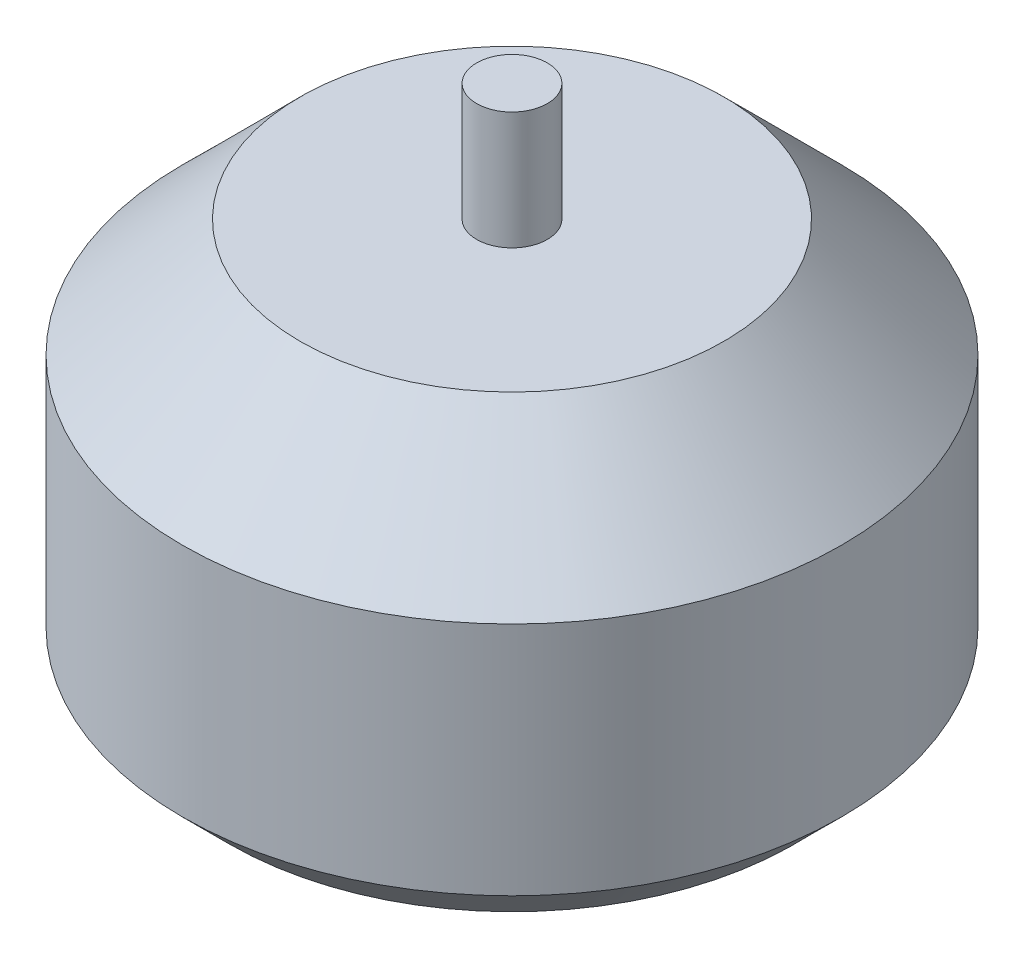
ISO-10303-21;
HEADER;
FILE_DESCRIPTION(('STEP AP214'),'2;1');
FILE_NAME('part.step','',(''),(''),'','','');
FILE_SCHEMA(('AUTOMOTIVE_DESIGN { 1 0 10303 214 1 1 1 1 }'));
ENDSEC;
DATA;
#1=APPLICATION_CONTEXT('core data for automotive mechanical design processes');
#2=APPLICATION_PROTOCOL_DEFINITION('international standard','automotive_design',2000,#1);
#3=PRODUCT_CONTEXT('',#1,'mechanical');
#4=PRODUCT('Part','Part','',(#3));
#5=PRODUCT_RELATED_PRODUCT_CATEGORY('part','',(#4));
#6=PRODUCT_DEFINITION_FORMATION('','',#4);
#7=PRODUCT_DEFINITION_CONTEXT('part definition',#1,'design');
#8=PRODUCT_DEFINITION('design','',#6,#7);
#9=PRODUCT_DEFINITION_SHAPE('','',#8);
#10=(LENGTH_UNIT() NAMED_UNIT(*) SI_UNIT(.MILLI.,.METRE.));
#11=(NAMED_UNIT(*) PLANE_ANGLE_UNIT() SI_UNIT($,.RADIAN.));
#12=(NAMED_UNIT(*) SI_UNIT($,.STERADIAN.) SOLID_ANGLE_UNIT());
#13=UNCERTAINTY_MEASURE_WITH_UNIT(LENGTH_MEASURE(1.E-05),#10,'distance_accuracy_value','');
#14=(GEOMETRIC_REPRESENTATION_CONTEXT(3) GLOBAL_UNCERTAINTY_ASSIGNED_CONTEXT((#13)) GLOBAL_UNIT_ASSIGNED_CONTEXT((#10,
#11,#12)) REPRESENTATION_CONTEXT('',''));
#15=CARTESIAN_POINT('',(0.,0.,0.));
#16=DIRECTION('',(0.,0.,1.));
#17=DIRECTION('',(1.,0.,0.));
#18=AXIS2_PLACEMENT_3D('',#15,#16,#17);
#19=CARTESIAN_POINT('',(0.,17.,0.));
#20=DIRECTION('',(0.,1.,0.));
#21=DIRECTION('',(0.,0.,1.));
#22=AXIS2_PLACEMENT_3D('',#19,#20,#21);
#23=PLANE('',#22);
#24=CARTESIAN_POINT('',(0.,17.,0.));
#25=DIRECTION('',(0.,1.,0.));
#26=DIRECTION('',(0.,0.,1.));
#27=AXIS2_PLACEMENT_3D('',#24,#25,#26);
#28=CIRCLE('',#27,9.00000000000001);
#29=CARTESIAN_POINT('',(0.,17.,9.00000000000001));
#30=VERTEX_POINT('',#29);
#31=EDGE_CURVE('E47',#30,#30,#28,.T.);
#32=ORIENTED_EDGE('',*,*,#31,.T.);
#33=EDGE_LOOP('',(#32));
#34=FACE_BOUND('',#33,.T.);
#35=CARTESIAN_POINT('',(0.,17.,0.));
#36=DIRECTION('',(0.,1.,0.));
#37=DIRECTION('',(0.,0.,1.));
#38=AXIS2_PLACEMENT_3D('',#35,#36,#37);
#39=CIRCLE('',#38,1.5);
#40=CARTESIAN_POINT('',(0.,17.,1.5));
#41=VERTEX_POINT('',#40);
#42=EDGE_CURVE('E77',#41,#41,#39,.T.);
#43=ORIENTED_EDGE('',*,*,#42,.F.);
#44=EDGE_LOOP('',(#43));
#45=FACE_BOUND('',#44,.T.);
#46=ADVANCED_FACE('F32',(#34,#45),#23,.T.);
#47=CARTESIAN_POINT('',(0.,17.,0.));
#48=DIRECTION('',(0.,-1.,0.));
#49=DIRECTION('',(0.,0.,-1.));
#50=AXIS2_PLACEMENT_3D('',#47,#48,#49);
#51=CYLINDRICAL_SURFACE('',#50,14.);
#52=CARTESIAN_POINT('',(0.,2.,0.));
#53=DIRECTION('',(0.,1.,0.));
#54=DIRECTION('',(0.,0.,1.));
#55=AXIS2_PLACEMENT_3D('',#52,#53,#54);
#56=CIRCLE('',#55,14.);
#57=CARTESIAN_POINT('',(0.,2.,14.));
#58=VERTEX_POINT('',#57);
#59=EDGE_CURVE('E39',#58,#58,#56,.T.);
#60=ORIENTED_EDGE('',*,*,#59,.T.);
#61=EDGE_LOOP('',(#60));
#62=FACE_BOUND('',#61,.T.);
#63=CARTESIAN_POINT('',(0.,12.,0.));
#64=DIRECTION('',(0.,1.,0.));
#65=DIRECTION('',(0.,0.,1.));
#66=AXIS2_PLACEMENT_3D('',#63,#64,#65);
#67=CIRCLE('',#66,14.);
#68=CARTESIAN_POINT('',(0.,12.,14.));
#69=VERTEX_POINT('',#68);
#70=EDGE_CURVE('E43',#69,#69,#67,.F.);
#71=ORIENTED_EDGE('',*,*,#70,.T.);
#72=EDGE_LOOP('',(#71));
#73=FACE_BOUND('',#72,.T.);
#74=ADVANCED_FACE('F93',(#62,#73),#51,.T.);
#75=CARTESIAN_POINT('',(0.,0.,0.));
#76=DIRECTION('',(0.,1.,0.));
#77=DIRECTION('',(0.,0.,1.));
#78=AXIS2_PLACEMENT_3D('',#75,#76,#77);
#79=PLANE('',#78);
#80=CARTESIAN_POINT('',(8.,0.,0.));
#81=DIRECTION('',(0.,-1.,0.));
#82=DIRECTION('',(0.,0.,-1.));
#83=AXIS2_PLACEMENT_3D('',#80,#81,#82);
#84=CIRCLE('',#83,1.65);
#85=CARTESIAN_POINT('',(8.,0.,-1.65));
#86=VERTEX_POINT('',#85);
#87=EDGE_CURVE('E71',#86,#86,#84,.T.);
#88=ORIENTED_EDGE('',*,*,#87,.F.);
#89=EDGE_LOOP('',(#88));
#90=FACE_BOUND('',#89,.T.);
#91=CARTESIAN_POINT('',(-8.,0.,0.));
#92=DIRECTION('',(0.,-1.,0.));
#93=DIRECTION('',(0.,0.,-1.));
#94=AXIS2_PLACEMENT_3D('',#91,#92,#93);
#95=CIRCLE('',#94,1.65);
#96=CARTESIAN_POINT('',(-8.,0.,-1.65));
#97=VERTEX_POINT('',#96);
#98=EDGE_CURVE('E65',#97,#97,#95,.T.);
#99=ORIENTED_EDGE('',*,*,#98,.F.);
#100=EDGE_LOOP('',(#99));
#101=FACE_BOUND('',#100,.T.);
#102=CARTESIAN_POINT('',(0.,0.,-9.5));
#103=DIRECTION('',(0.,-1.,0.));
#104=DIRECTION('',(0.,0.,-1.));
#105=AXIS2_PLACEMENT_3D('',#102,#103,#104);
#106=CIRCLE('',#105,1.65);
#107=CARTESIAN_POINT('',(0.,0.,-11.15));
#108=VERTEX_POINT('',#107);
#109=EDGE_CURVE('E59',#108,#108,#106,.T.);
#110=ORIENTED_EDGE('',*,*,#109,.F.);
#111=EDGE_LOOP('',(#110));
#112=FACE_BOUND('',#111,.T.);
#113=CARTESIAN_POINT('',(0.,0.,9.5));
#114=DIRECTION('',(0.,-1.,0.));
#115=DIRECTION('',(0.,0.,-1.));
#116=AXIS2_PLACEMENT_3D('',#113,#114,#115);
#117=CIRCLE('',#116,1.65);
#118=CARTESIAN_POINT('',(0.,0.,7.85));
#119=VERTEX_POINT('',#118);
#120=EDGE_CURVE('E53',#119,#119,#117,.T.);
#121=ORIENTED_EDGE('',*,*,#120,.F.);
#122=EDGE_LOOP('',(#121));
#123=FACE_BOUND('',#122,.T.);
#124=CARTESIAN_POINT('',(0.,0.,0.));
#125=DIRECTION('',(0.,1.,0.));
#126=DIRECTION('',(0.,0.,1.));
#127=AXIS2_PLACEMENT_3D('',#124,#125,#126);
#128=CIRCLE('',#127,12.);
#129=CARTESIAN_POINT('',(0.,0.,12.));
#130=VERTEX_POINT('',#129);
#131=EDGE_CURVE('E10',#130,#130,#128,.F.);
#132=ORIENTED_EDGE('',*,*,#131,.T.);
#133=EDGE_LOOP('',(#132));
#134=FACE_BOUND('',#133,.T.);
#135=ADVANCED_FACE('F99',(#90,#101,#112,#123,#134),#79,.F.);
#136=CARTESIAN_POINT('',(0.,17.,0.));
#137=DIRECTION('',(0.,-1.,0.));
#138=DIRECTION('',(0.,0.,-1.));
#139=AXIS2_PLACEMENT_3D('',#136,#137,#138);
#140=CONICAL_SURFACE('',#139,9.00000000000001,0.785398163397446);
#141=ORIENTED_EDGE('',*,*,#70,.F.);
#142=EDGE_LOOP('',(#141));
#143=FACE_BOUND('',#142,.T.);
#144=ORIENTED_EDGE('',*,*,#31,.F.);
#145=EDGE_LOOP('',(#144));
#146=FACE_BOUND('',#145,.T.);
#147=ADVANCED_FACE('F106',(#143,#146),#140,.T.);
#148=CARTESIAN_POINT('',(0.,2.,0.));
#149=DIRECTION('',(0.,1.,0.));
#150=DIRECTION('',(0.,0.,1.));
#151=AXIS2_PLACEMENT_3D('',#148,#149,#150);
#152=CONICAL_SURFACE('',#151,14.,0.78539816339745);
#153=ORIENTED_EDGE('',*,*,#131,.F.);
#154=EDGE_LOOP('',(#153));
#155=FACE_BOUND('',#154,.T.);
#156=ORIENTED_EDGE('',*,*,#59,.F.);
#157=EDGE_LOOP('',(#156));
#158=FACE_BOUND('',#157,.T.);
#159=ADVANCED_FACE('F34',(#155,#158),#152,.T.);
#160=CARTESIAN_POINT('',(0.,5.,9.5));
#161=DIRECTION('',(0.,-1.,0.));
#162=DIRECTION('',(0.,0.,-1.));
#163=AXIS2_PLACEMENT_3D('',#160,#161,#162);
#164=CYLINDRICAL_SURFACE('',#163,1.65);
#165=CARTESIAN_POINT('',(0.,5.,9.5));
#166=DIRECTION('',(0.,-1.,0.));
#167=DIRECTION('',(0.,0.,-1.));
#168=AXIS2_PLACEMENT_3D('',#165,#166,#167);
#169=CIRCLE('',#168,1.65);
#170=CARTESIAN_POINT('',(0.,5.,7.85));
#171=VERTEX_POINT('',#170);
#172=EDGE_CURVE('E52',#171,#171,#169,.T.);
#173=ORIENTED_EDGE('',*,*,#172,.F.);
#174=EDGE_LOOP('',(#173));
#175=FACE_BOUND('',#174,.T.);
#176=ORIENTED_EDGE('',*,*,#120,.T.);
#177=EDGE_LOOP('',(#176));
#178=FACE_BOUND('',#177,.T.);
#179=ADVANCED_FACE('F103',(#175,#178),#164,.F.);
#180=CARTESIAN_POINT('',(0.,5.,9.5));
#181=DIRECTION('',(0.,-1.,0.));
#182=DIRECTION('',(0.,0.,-1.));
#183=AXIS2_PLACEMENT_3D('',#180,#181,#182);
#184=PLANE('',#183);
#185=ORIENTED_EDGE('',*,*,#172,.T.);
#186=EDGE_LOOP('',(#185));
#187=FACE_BOUND('',#186,.T.);
#188=ADVANCED_FACE('F121',(#187),#184,.T.);
#189=CARTESIAN_POINT('',(0.,5.,-9.5));
#190=DIRECTION('',(0.,-1.,0.));
#191=DIRECTION('',(0.,0.,-1.));
#192=AXIS2_PLACEMENT_3D('',#189,#190,#191);
#193=CYLINDRICAL_SURFACE('',#192,1.65);
#194=CARTESIAN_POINT('',(0.,5.,-9.5));
#195=DIRECTION('',(0.,-1.,0.));
#196=DIRECTION('',(0.,0.,-1.));
#197=AXIS2_PLACEMENT_3D('',#194,#195,#196);
#198=CIRCLE('',#197,1.65);
#199=CARTESIAN_POINT('',(0.,5.,-11.15));
#200=VERTEX_POINT('',#199);
#201=EDGE_CURVE('E56',#200,#200,#198,.T.);
#202=ORIENTED_EDGE('',*,*,#201,.F.);
#203=EDGE_LOOP('',(#202));
#204=FACE_BOUND('',#203,.T.);
#205=ORIENTED_EDGE('',*,*,#109,.T.);
#206=EDGE_LOOP('',(#205));
#207=FACE_BOUND('',#206,.T.);
#208=ADVANCED_FACE('F127',(#204,#207),#193,.F.);
#209=CARTESIAN_POINT('',(0.,5.,-9.5));
#210=DIRECTION('',(0.,-1.,0.));
#211=DIRECTION('',(0.,0.,-1.));
#212=AXIS2_PLACEMENT_3D('',#209,#210,#211);
#213=PLANE('',#212);
#214=ORIENTED_EDGE('',*,*,#201,.T.);
#215=EDGE_LOOP('',(#214));
#216=FACE_BOUND('',#215,.T.);
#217=ADVANCED_FACE('F136',(#216),#213,.T.);
#218=CARTESIAN_POINT('',(-8.,5.,0.));
#219=DIRECTION('',(0.,-1.,0.));
#220=DIRECTION('',(0.,0.,-1.));
#221=AXIS2_PLACEMENT_3D('',#218,#219,#220);
#222=CYLINDRICAL_SURFACE('',#221,1.65);
#223=CARTESIAN_POINT('',(-8.,5.,0.));
#224=DIRECTION('',(0.,-1.,0.));
#225=DIRECTION('',(0.,0.,-1.));
#226=AXIS2_PLACEMENT_3D('',#223,#224,#225);
#227=CIRCLE('',#226,1.65);
#228=CARTESIAN_POINT('',(-8.,5.,-1.65));
#229=VERTEX_POINT('',#228);
#230=EDGE_CURVE('E62',#229,#229,#227,.T.);
#231=ORIENTED_EDGE('',*,*,#230,.F.);
#232=EDGE_LOOP('',(#231));
#233=FACE_BOUND('',#232,.T.);
#234=ORIENTED_EDGE('',*,*,#98,.T.);
#235=EDGE_LOOP('',(#234));
#236=FACE_BOUND('',#235,.T.);
#237=ADVANCED_FACE('F142',(#233,#236),#222,.F.);
#238=CARTESIAN_POINT('',(-8.,5.,0.));
#239=DIRECTION('',(0.,-1.,0.));
#240=DIRECTION('',(0.,0.,-1.));
#241=AXIS2_PLACEMENT_3D('',#238,#239,#240);
#242=PLANE('',#241);
#243=ORIENTED_EDGE('',*,*,#230,.T.);
#244=EDGE_LOOP('',(#243));
#245=FACE_BOUND('',#244,.T.);
#246=ADVANCED_FACE('F146',(#245),#242,.T.);
#247=CARTESIAN_POINT('',(8.,5.,0.));
#248=DIRECTION('',(0.,-1.,0.));
#249=DIRECTION('',(0.,0.,-1.));
#250=AXIS2_PLACEMENT_3D('',#247,#248,#249);
#251=CYLINDRICAL_SURFACE('',#250,1.65);
#252=CARTESIAN_POINT('',(8.,5.,0.));
#253=DIRECTION('',(0.,-1.,0.));
#254=DIRECTION('',(0.,0.,-1.));
#255=AXIS2_PLACEMENT_3D('',#252,#253,#254);
#256=CIRCLE('',#255,1.65);
#257=CARTESIAN_POINT('',(8.,5.,-1.65));
#258=VERTEX_POINT('',#257);
#259=EDGE_CURVE('E68',#258,#258,#256,.T.);
#260=ORIENTED_EDGE('',*,*,#259,.F.);
#261=EDGE_LOOP('',(#260));
#262=FACE_BOUND('',#261,.T.);
#263=ORIENTED_EDGE('',*,*,#87,.T.);
#264=EDGE_LOOP('',(#263));
#265=FACE_BOUND('',#264,.T.);
#266=ADVANCED_FACE('F150',(#262,#265),#251,.F.);
#267=CARTESIAN_POINT('',(8.,5.,0.));
#268=DIRECTION('',(0.,-1.,0.));
#269=DIRECTION('',(0.,0.,-1.));
#270=AXIS2_PLACEMENT_3D('',#267,#268,#269);
#271=PLANE('',#270);
#272=ORIENTED_EDGE('',*,*,#259,.T.);
#273=EDGE_LOOP('',(#272));
#274=FACE_BOUND('',#273,.T.);
#275=ADVANCED_FACE('F88',(#274),#271,.T.);
#276=CARTESIAN_POINT('',(0.,22.,0.));
#277=DIRECTION('',(0.,-1.,0.));
#278=DIRECTION('',(0.,0.,-1.));
#279=AXIS2_PLACEMENT_3D('',#276,#277,#278);
#280=CYLINDRICAL_SURFACE('',#279,1.5);
#281=CARTESIAN_POINT('',(0.,22.,0.));
#282=DIRECTION('',(0.,1.,0.));
#283=DIRECTION('',(0.,0.,1.));
#284=AXIS2_PLACEMENT_3D('',#281,#282,#283);
#285=CIRCLE('',#284,1.5);
#286=CARTESIAN_POINT('',(0.,22.,1.5));
#287=VERTEX_POINT('',#286);
#288=EDGE_CURVE('E74',#287,#287,#285,.T.);
#289=ORIENTED_EDGE('',*,*,#288,.F.);
#290=EDGE_LOOP('',(#289));
#291=FACE_BOUND('',#290,.T.);
#292=ORIENTED_EDGE('',*,*,#42,.T.);
#293=EDGE_LOOP('',(#292));
#294=FACE_BOUND('',#293,.T.);
#295=ADVANCED_FACE('F85',(#291,#294),#280,.T.);
#296=CARTESIAN_POINT('',(0.,22.,0.));
#297=DIRECTION('',(0.,1.,0.));
#298=DIRECTION('',(0.,0.,1.));
#299=AXIS2_PLACEMENT_3D('',#296,#297,#298);
#300=PLANE('',#299);
#301=ORIENTED_EDGE('',*,*,#288,.T.);
#302=EDGE_LOOP('',(#301));
#303=FACE_BOUND('',#302,.T.);
#304=ADVANCED_FACE('F83',(#303),#300,.T.);
#305=CLOSED_SHELL('',(#46,#74,#135,#147,#159,#179,#188,#208,#217,#237,#246,#266,#275,#295,#304));
#306=MANIFOLD_SOLID_BREP('B2',#305);
#307=ADVANCED_BREP_SHAPE_REPRESENTATION('',(#18,#306),#14);
#308=SHAPE_DEFINITION_REPRESENTATION(#9,#307);
ENDSEC;
END-ISO-10303-21;
